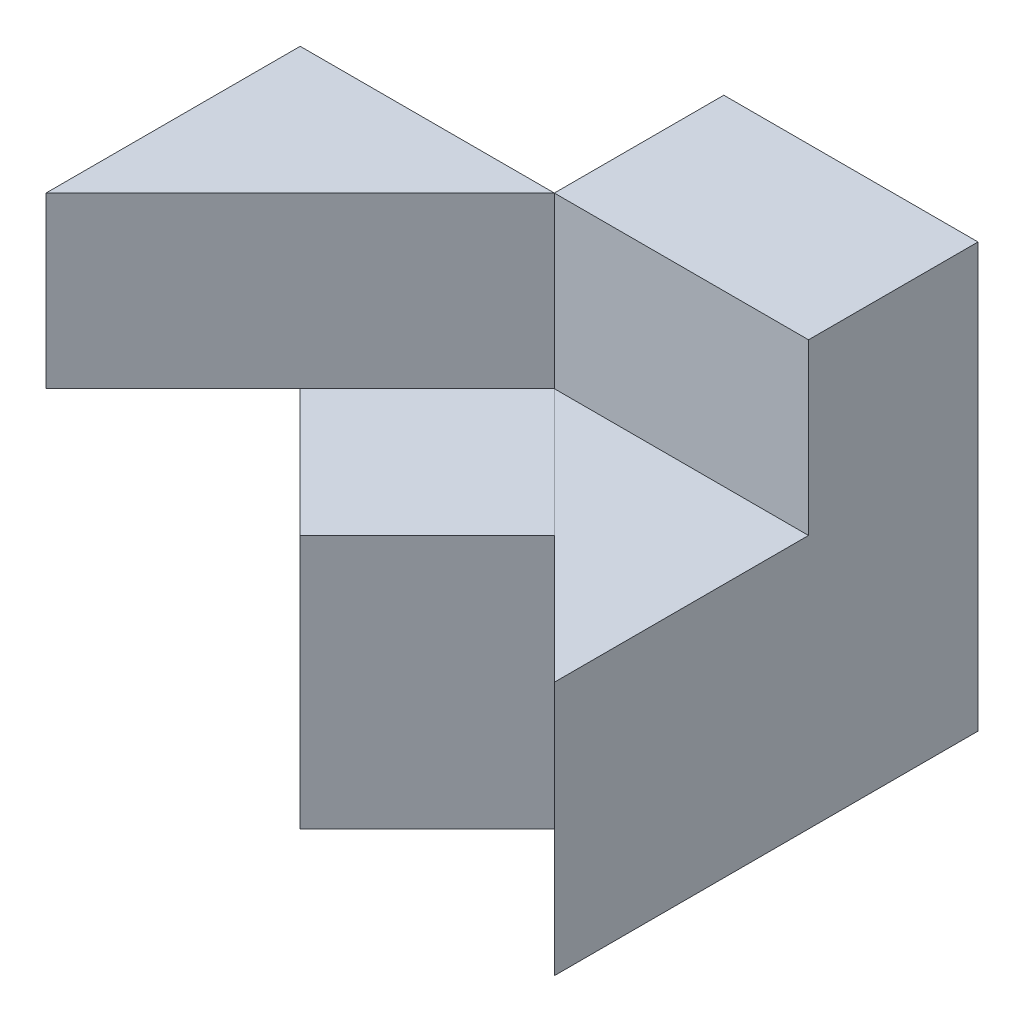
ISO-10303-21;
HEADER;
FILE_DESCRIPTION(('STEP AP214'),'2;1');
FILE_NAME('part.step','',(''),(''),'','','');
FILE_SCHEMA(('AUTOMOTIVE_DESIGN { 1 0 10303 214 1 1 1 1 }'));
ENDSEC;
DATA;
#1=APPLICATION_CONTEXT('core data for automotive mechanical design processes');
#2=APPLICATION_PROTOCOL_DEFINITION('international standard','automotive_design',2000,#1);
#3=PRODUCT_CONTEXT('',#1,'mechanical');
#4=PRODUCT('Part','Part','',(#3));
#5=PRODUCT_RELATED_PRODUCT_CATEGORY('part','',(#4));
#6=PRODUCT_DEFINITION_FORMATION('','',#4);
#7=PRODUCT_DEFINITION_CONTEXT('part definition',#1,'design');
#8=PRODUCT_DEFINITION('design','',#6,#7);
#9=PRODUCT_DEFINITION_SHAPE('','',#8);
#10=(LENGTH_UNIT() NAMED_UNIT(*) SI_UNIT(.MILLI.,.METRE.));
#11=(NAMED_UNIT(*) PLANE_ANGLE_UNIT() SI_UNIT($,.RADIAN.));
#12=(NAMED_UNIT(*) SI_UNIT($,.STERADIAN.) SOLID_ANGLE_UNIT());
#13=UNCERTAINTY_MEASURE_WITH_UNIT(LENGTH_MEASURE(1.E-05),#10,'distance_accuracy_value','');
#14=(GEOMETRIC_REPRESENTATION_CONTEXT(3) GLOBAL_UNCERTAINTY_ASSIGNED_CONTEXT((#13)) GLOBAL_UNIT_ASSIGNED_CONTEXT((#10,
#11,#12)) REPRESENTATION_CONTEXT('',''));
#15=CARTESIAN_POINT('',(0.,0.,0.));
#16=DIRECTION('',(0.,0.,1.));
#17=DIRECTION('',(1.,0.,0.));
#18=AXIS2_PLACEMENT_3D('',#15,#16,#17);
#19=CARTESIAN_POINT('',(60.,30.,20.001));
#20=DIRECTION('',(0.,-1.,0.));
#21=DIRECTION('',(1.,0.,0.));
#22=AXIS2_PLACEMENT_3D('',#19,#20,#21);
#23=PLANE('',#22);
#24=DIRECTION('',(-0.707130351805411,0.,-0.707083209781957));
#25=VECTOR('',#24,1.);
#26=CARTESIAN_POINT('',(4.99849998889148,30.,-4.99883324444111));
#27=LINE('',#26,#25);
#28=CARTESIAN_POINT('',(45.,30.,35.));
#29=VERTEX_POINT('',#28);
#30=CARTESIAN_POINT('',(30.,30.,20.001));
#31=VERTEX_POINT('',#30);
#32=EDGE_CURVE('E201',#29,#31,#27,.T.);
#33=ORIENTED_EDGE('',*,*,#32,.F.);
#34=DIRECTION('',(0.707106781186548,0.,0.707106781186547));
#35=VECTOR('',#34,1.);
#36=CARTESIAN_POINT('',(4.99999999999998,30.,-4.99999999999999));
#37=LINE('',#36,#35);
#38=CARTESIAN_POINT('',(60.,30.,50.));
#39=VERTEX_POINT('',#38);
#40=EDGE_CURVE('E275',#29,#39,#37,.T.);
#41=ORIENTED_EDGE('',*,*,#40,.T.);
#42=DIRECTION('',(0.,0.,1.));
#43=VECTOR('',#42,1.);
#44=CARTESIAN_POINT('',(60.,30.,20.001));
#45=LINE('',#44,#43);
#46=CARTESIAN_POINT('',(60.,30.,20.001));
#47=VERTEX_POINT('',#46);
#48=EDGE_CURVE('E272',#47,#39,#45,.T.);
#49=ORIENTED_EDGE('',*,*,#48,.F.);
#50=DIRECTION('',(1.,0.,0.));
#51=VECTOR('',#50,1.);
#52=CARTESIAN_POINT('',(60.,30.,20.001));
#53=LINE('',#52,#51);
#54=EDGE_CURVE('E269',#31,#47,#53,.T.);
#55=ORIENTED_EDGE('',*,*,#54,.F.);
#56=EDGE_LOOP('',(#33,#41,#49,#55));
#57=FACE_BOUND('',#56,.T.);
#58=ADVANCED_FACE('F54',(#57),#23,.F.);
#59=CARTESIAN_POINT('',(30.,30.,20.001));
#60=DIRECTION('',(0.707094995778895,0.,0.707118566397775));
#61=DIRECTION('',(0.707118566397775,0.,-0.707094995778895));
#62=AXIS2_PLACEMENT_3D('',#59,#60,#61);
#63=PLANE('',#62);
#64=DIRECTION('',(0.707118566397775,0.,-0.707094995778895));
#65=VECTOR('',#64,1.);
#66=CARTESIAN_POINT('',(30.,30.,20.001));
#67=LINE('',#66,#65);
#68=CARTESIAN_POINT('',(0.,30.,50.));
#69=VERTEX_POINT('',#68);
#70=CARTESIAN_POINT('',(15.0002500041667,30.,35.0002500041667));
#71=VERTEX_POINT('',#70);
#72=EDGE_CURVE('E234',#69,#71,#67,.T.);
#73=ORIENTED_EDGE('',*,*,#72,.T.);
#74=DIRECTION('',(0.,-1.,0.));
#75=VECTOR('',#74,1.);
#76=CARTESIAN_POINT('',(15.0002500041667,30.0001,35.0002500041667));
#77=LINE('',#76,#75);
#78=CARTESIAN_POINT('',(15.0002500041667,30.0001,35.0002500041667));
#79=VERTEX_POINT('',#78);
#80=EDGE_CURVE('E211',#79,#71,#77,.T.);
#81=ORIENTED_EDGE('',*,*,#80,.F.);
#82=DIRECTION('',(-0.707118566397775,0.,0.707094995778895));
#83=VECTOR('',#82,1.);
#84=CARTESIAN_POINT('',(24.9999999861107,30.0001,25.0008333472222));
#85=LINE('',#84,#83);
#86=CARTESIAN_POINT('',(30.,30.0001,20.001));
#87=VERTEX_POINT('',#86);
#88=EDGE_CURVE('E69',#87,#79,#85,.T.);
#89=ORIENTED_EDGE('',*,*,#88,.F.);
#90=DIRECTION('',(0.,-1.,0.));
#91=VECTOR('',#90,1.);
#92=CARTESIAN_POINT('',(30.,50.,20.001));
#93=LINE('',#92,#91);
#94=CARTESIAN_POINT('',(30.,50.,20.001));
#95=VERTEX_POINT('',#94);
#96=EDGE_CURVE('E267',#95,#87,#93,.T.);
#97=ORIENTED_EDGE('',*,*,#96,.F.);
#98=DIRECTION('',(0.707118566397775,0.,-0.707094995778895));
#99=VECTOR('',#98,1.);
#100=CARTESIAN_POINT('',(30.,50.,20.001));
#101=LINE('',#100,#99);
#102=CARTESIAN_POINT('',(0.,50.,50.));
#103=VERTEX_POINT('',#102);
#104=EDGE_CURVE('E233',#103,#95,#101,.T.);
#105=ORIENTED_EDGE('',*,*,#104,.F.);
#106=DIRECTION('',(0.,-1.,0.));
#107=VECTOR('',#106,1.);
#108=CARTESIAN_POINT('',(0.,0.,50.));
#109=LINE('',#108,#107);
#110=EDGE_CURVE('E307',#103,#69,#109,.T.);
#111=ORIENTED_EDGE('',*,*,#110,.T.);
#112=EDGE_LOOP('',(#73,#81,#89,#97,#105,#111));
#113=FACE_BOUND('',#112,.T.);
#114=ADVANCED_FACE('F371',(#113),#63,.T.);
#115=CARTESIAN_POINT('',(4.99999999999998,0.,-4.99999999999998));
#116=DIRECTION('',(-0.707106781186547,0.,0.707106781186548));
#117=DIRECTION('',(0.707106781186548,0.,0.707106781186547));
#118=AXIS2_PLACEMENT_3D('',#115,#116,#117);
#119=PLANE('',#118);
#120=DIRECTION('',(0.,1.,0.));
#121=VECTOR('',#120,1.);
#122=CARTESIAN_POINT('',(45.,0.,35.));
#123=LINE('',#122,#121);
#124=CARTESIAN_POINT('',(45.,0.0001,35.));
#125=VERTEX_POINT('',#124);
#126=EDGE_CURVE('E206',#125,#29,#123,.T.);
#127=ORIENTED_EDGE('',*,*,#126,.F.);
#128=DIRECTION('',(-0.707106781186548,0.,-0.707106781186547));
#129=VECTOR('',#128,1.);
#130=CARTESIAN_POINT('',(60.,0.0001,50.));
#131=LINE('',#130,#129);
#132=CARTESIAN_POINT('',(60.,0.0001,50.));
#133=VERTEX_POINT('',#132);
#134=EDGE_CURVE('E77',#133,#125,#131,.T.);
#135=ORIENTED_EDGE('',*,*,#134,.F.);
#136=DIRECTION('',(0.,1.,0.));
#137=VECTOR('',#136,1.);
#138=CARTESIAN_POINT('',(60.,0.,50.));
#139=LINE('',#138,#137);
#140=EDGE_CURVE('E310',#133,#39,#139,.T.);
#141=ORIENTED_EDGE('',*,*,#140,.T.);
#142=ORIENTED_EDGE('',*,*,#40,.F.);
#143=EDGE_LOOP('',(#127,#135,#141,#142));
#144=FACE_BOUND('',#143,.T.);
#145=ADVANCED_FACE('F365',(#144),#119,.T.);
#146=CARTESIAN_POINT('',(0.,0.,50.));
#147=DIRECTION('',(1.,0.,0.));
#148=DIRECTION('',(0.,0.,-1.));
#149=AXIS2_PLACEMENT_3D('',#146,#147,#148);
#150=PLANE('',#149);
#151=DIRECTION('',(0.,-1.,0.));
#152=VECTOR('',#151,1.);
#153=CARTESIAN_POINT('',(0.,29.9991,20.001));
#154=LINE('',#153,#152);
#155=CARTESIAN_POINT('',(0.,29.9991,20.001));
#156=VERTEX_POINT('',#155);
#157=CARTESIAN_POINT('',(0.,29.999,20.001));
#158=VERTEX_POINT('',#157);
#159=EDGE_CURVE('E229',#156,#158,#154,.T.);
#160=ORIENTED_EDGE('',*,*,#159,.F.);
#161=DIRECTION('',(0.,0.,-1.));
#162=VECTOR('',#161,1.);
#163=CARTESIAN_POINT('',(0.,29.9991,0.));
#164=LINE('',#163,#162);
#165=CARTESIAN_POINT('',(0.,29.9991,50.));
#166=VERTEX_POINT('',#165);
#167=EDGE_CURVE('E226',#166,#156,#164,.T.);
#168=ORIENTED_EDGE('',*,*,#167,.F.);
#169=EDGE_CURVE('E311',#69,#166,#109,.T.);
#170=ORIENTED_EDGE('',*,*,#169,.F.);
#171=ORIENTED_EDGE('',*,*,#110,.F.);
#172=DIRECTION('',(0.,0.,-1.));
#173=VECTOR('',#172,1.);
#174=CARTESIAN_POINT('',(0.,50.,50.));
#175=LINE('',#174,#173);
#176=CARTESIAN_POINT('',(0.,50.,20.));
#177=VERTEX_POINT('',#176);
#178=EDGE_CURVE('E313',#103,#177,#175,.T.);
#179=ORIENTED_EDGE('',*,*,#178,.T.);
#180=DIRECTION('',(0.,1.,0.));
#181=VECTOR('',#180,1.);
#182=CARTESIAN_POINT('',(0.,0.,20.));
#183=LINE('',#182,#181);
#184=CARTESIAN_POINT('',(0.,0.,20.));
#185=VERTEX_POINT('',#184);
#186=EDGE_CURVE('E296',#185,#177,#183,.T.);
#187=ORIENTED_EDGE('',*,*,#186,.F.);
#188=DIRECTION('',(0.,0.,-1.));
#189=VECTOR('',#188,1.);
#190=CARTESIAN_POINT('',(0.,0.,50.));
#191=LINE('',#190,#189);
#192=CARTESIAN_POINT('',(0.,0.,20.001));
#193=VERTEX_POINT('',#192);
#194=EDGE_CURVE('E62',#193,#185,#191,.T.);
#195=ORIENTED_EDGE('',*,*,#194,.F.);
#196=DIRECTION('',(0.,-1.,0.));
#197=VECTOR('',#196,1.);
#198=CARTESIAN_POINT('',(0.,0.,20.001));
#199=LINE('',#198,#197);
#200=EDGE_CURVE('E244',#158,#193,#199,.T.);
#201=ORIENTED_EDGE('',*,*,#200,.F.);
#202=EDGE_LOOP('',(#160,#168,#170,#171,#179,#187,#195,#201));
#203=FACE_BOUND('',#202,.T.);
#204=ADVANCED_FACE('F56',(#203),#150,.F.);
#205=CARTESIAN_POINT('',(25.,0.,25.));
#206=DIRECTION('',(0.707106781186548,0.,0.707106781186548));
#207=DIRECTION('',(0.707106781186548,0.,-0.707106781186548));
#208=AXIS2_PLACEMENT_3D('',#205,#206,#207);
#209=PLANE('',#208);
#210=ORIENTED_EDGE('',*,*,#169,.T.);
#211=DIRECTION('',(-0.707106781186548,0.,0.707106781186548));
#212=VECTOR('',#211,1.);
#213=CARTESIAN_POINT('',(25.,29.9991,25.));
#214=LINE('',#213,#212);
#215=CARTESIAN_POINT('',(15.,29.9991,35.));
#216=VERTEX_POINT('',#215);
#217=EDGE_CURVE('E224',#216,#166,#214,.T.);
#218=ORIENTED_EDGE('',*,*,#217,.F.);
#219=DIRECTION('',(0.,1.,0.));
#220=VECTOR('',#219,1.);
#221=CARTESIAN_POINT('',(15.,0.,35.));
#222=LINE('',#221,#220);
#223=CARTESIAN_POINT('',(15.,30.,35.));
#224=VERTEX_POINT('',#223);
#225=EDGE_CURVE('E283',#216,#224,#222,.T.);
#226=ORIENTED_EDGE('',*,*,#225,.T.);
#227=DIRECTION('',(0.707106781186548,0.,-0.707106781186548));
#228=VECTOR('',#227,1.);
#229=CARTESIAN_POINT('',(25.,30.,25.));
#230=LINE('',#229,#228);
#231=EDGE_CURVE('E237',#69,#224,#230,.T.);
#232=ORIENTED_EDGE('',*,*,#231,.F.);
#233=EDGE_LOOP('',(#210,#218,#226,#232));
#234=FACE_BOUND('',#233,.T.);
#235=ADVANCED_FACE('F402',(#234),#209,.T.);
#236=CARTESIAN_POINT('',(0.,29.999,20.001));
#237=DIRECTION('',(0.,1.,0.));
#238=DIRECTION('',(0.,0.,1.));
#239=AXIS2_PLACEMENT_3D('',#236,#237,#238);
#240=PLANE('',#239);
#241=DIRECTION('',(-0.707130351805411,0.,-0.707083209781957));
#242=VECTOR('',#241,1.);
#243=CARTESIAN_POINT('',(-10.0004999777752,29.999,10.0011667222233));
#244=LINE('',#243,#242);
#245=CARTESIAN_POINT('',(15.,29.999,35.));
#246=VERTEX_POINT('',#245);
#247=EDGE_CURVE('E221',#246,#158,#244,.T.);
#248=ORIENTED_EDGE('',*,*,#247,.T.);
#249=DIRECTION('',(-1.,0.,0.));
#250=VECTOR('',#249,1.);
#251=CARTESIAN_POINT('',(0.,29.999,20.001));
#252=LINE('',#251,#250);
#253=CARTESIAN_POINT('',(29.999,29.999,20.001));
#254=VERTEX_POINT('',#253);
#255=EDGE_CURVE('E252',#254,#158,#252,.T.);
#256=ORIENTED_EDGE('',*,*,#255,.F.);
#257=DIRECTION('',(0.,0.,1.));
#258=VECTOR('',#257,1.);
#259=CARTESIAN_POINT('',(29.999,29.999,20.001));
#260=LINE('',#259,#258);
#261=CARTESIAN_POINT('',(29.999,29.999,49.999));
#262=VERTEX_POINT('',#261);
#263=EDGE_CURVE('E256',#254,#262,#260,.T.);
#264=ORIENTED_EDGE('',*,*,#263,.T.);
#265=DIRECTION('',(-0.707106781186548,0.,-0.707106781186548));
#266=VECTOR('',#265,1.);
#267=CARTESIAN_POINT('',(-10.,29.999,10.));
#268=LINE('',#267,#266);
#269=EDGE_CURVE('E259',#262,#246,#268,.T.);
#270=ORIENTED_EDGE('',*,*,#269,.T.);
#271=EDGE_LOOP('',(#248,#256,#264,#270));
#272=FACE_BOUND('',#271,.T.);
#273=ADVANCED_FACE('F397',(#272),#240,.F.);
#274=CARTESIAN_POINT('',(-10.,0.,10.));
#275=DIRECTION('',(-0.707106781186548,0.,0.707106781186548));
#276=DIRECTION('',(0.707106781186548,0.,0.707106781186548));
#277=AXIS2_PLACEMENT_3D('',#274,#275,#276);
#278=PLANE('',#277);
#279=DIRECTION('',(0.,1.,0.));
#280=VECTOR('',#279,1.);
#281=CARTESIAN_POINT('',(30.,0.,50.));
#282=LINE('',#281,#280);
#283=CARTESIAN_POINT('',(30.,0.,50.));
#284=VERTEX_POINT('',#283);
#285=CARTESIAN_POINT('',(30.,30.0001,50.));
#286=VERTEX_POINT('',#285);
#287=EDGE_CURVE('E284',#284,#286,#282,.T.);
#288=ORIENTED_EDGE('',*,*,#287,.T.);
#289=DIRECTION('',(0.707106781186548,0.,0.707106781186547));
#290=VECTOR('',#289,1.);
#291=CARTESIAN_POINT('',(-10.,30.0001,10.));
#292=LINE('',#291,#290);
#293=EDGE_CURVE('E198',#79,#286,#292,.T.);
#294=ORIENTED_EDGE('',*,*,#293,.F.);
#295=ORIENTED_EDGE('',*,*,#80,.T.);
#296=DIRECTION('',(0.707106781186548,0.,0.707106781186547));
#297=VECTOR('',#296,1.);
#298=CARTESIAN_POINT('',(30.,30.,50.));
#299=LINE('',#298,#297);
#300=EDGE_CURVE('E242',#224,#71,#299,.T.);
#301=ORIENTED_EDGE('',*,*,#300,.F.);
#302=ORIENTED_EDGE('',*,*,#225,.F.);
#303=EDGE_CURVE('E287',#246,#216,#222,.T.);
#304=ORIENTED_EDGE('',*,*,#303,.F.);
#305=ORIENTED_EDGE('',*,*,#269,.F.);
#306=DIRECTION('',(0.,1.,0.));
#307=VECTOR('',#306,1.);
#308=CARTESIAN_POINT('',(29.999,0.,49.999));
#309=LINE('',#308,#307);
#310=CARTESIAN_POINT('',(29.999,0.,49.999));
#311=VERTEX_POINT('',#310);
#312=EDGE_CURVE('E12',#311,#262,#309,.T.);
#313=ORIENTED_EDGE('',*,*,#312,.F.);
#314=DIRECTION('',(0.707106781186548,0.,0.707106781186548));
#315=VECTOR('',#314,1.);
#316=CARTESIAN_POINT('',(-10.,0.,10.));
#317=LINE('',#316,#315);
#318=EDGE_CURVE('E281',#311,#284,#317,.T.);
#319=ORIENTED_EDGE('',*,*,#318,.T.);
#320=EDGE_LOOP('',(#288,#294,#295,#301,#302,#304,#305,#313,#319));
#321=FACE_BOUND('',#320,.T.);
#322=ADVANCED_FACE('F379',(#321),#278,.T.);
#323=CARTESIAN_POINT('',(0.,0.,50.));
#324=DIRECTION('',(0.,1.,0.));
#325=DIRECTION('',(0.,0.,1.));
#326=AXIS2_PLACEMENT_3D('',#323,#324,#325);
#327=PLANE('',#326);
#328=DIRECTION('',(0.,0.,-1.));
#329=VECTOR('',#328,1.);
#330=CARTESIAN_POINT('',(60.,0.,50.));
#331=LINE('',#330,#329);
#332=CARTESIAN_POINT('',(60.,0.,20.0000000000002));
#333=VERTEX_POINT('',#332);
#334=CARTESIAN_POINT('',(60.,0.,0.));
#335=VERTEX_POINT('',#334);
#336=EDGE_CURVE('E326',#333,#335,#331,.T.);
#337=ORIENTED_EDGE('',*,*,#336,.F.);
#338=DIRECTION('',(0.707106781186547,0.,-0.707106781186548));
#339=VECTOR('',#338,1.);
#340=CARTESIAN_POINT('',(40.,0.,40.));
#341=LINE('',#340,#339);
#342=EDGE_CURVE('E279',#284,#333,#341,.T.);
#343=ORIENTED_EDGE('',*,*,#342,.F.);
#344=ORIENTED_EDGE('',*,*,#318,.F.);
#345=DIRECTION('',(0.,0.,1.));
#346=VECTOR('',#345,1.);
#347=CARTESIAN_POINT('',(29.999,0.,20.001));
#348=LINE('',#347,#346);
#349=CARTESIAN_POINT('',(29.999,0.,20.001));
#350=VERTEX_POINT('',#349);
#351=EDGE_CURVE('E255',#350,#311,#348,.T.);
#352=ORIENTED_EDGE('',*,*,#351,.F.);
#353=DIRECTION('',(1.,0.,0.));
#354=VECTOR('',#353,1.);
#355=CARTESIAN_POINT('',(0.,0.,20.001));
#356=LINE('',#355,#354);
#357=EDGE_CURVE('E246',#193,#350,#356,.T.);
#358=ORIENTED_EDGE('',*,*,#357,.F.);
#359=ORIENTED_EDGE('',*,*,#194,.T.);
#360=DIRECTION('',(1.,0.,0.));
#361=VECTOR('',#360,1.);
#362=CARTESIAN_POINT('',(0.,0.,20.));
#363=LINE('',#362,#361);
#364=CARTESIAN_POINT('',(30.,0.,20.));
#365=VERTEX_POINT('',#364);
#366=EDGE_CURVE('E289',#185,#365,#363,.T.);
#367=ORIENTED_EDGE('',*,*,#366,.T.);
#368=DIRECTION('',(0.,0.,-1.));
#369=VECTOR('',#368,1.);
#370=CARTESIAN_POINT('',(30.,0.,0.));
#371=LINE('',#370,#369);
#372=CARTESIAN_POINT('',(30.,0.,0.));
#373=VERTEX_POINT('',#372);
#374=EDGE_CURVE('E292',#365,#373,#371,.T.);
#375=ORIENTED_EDGE('',*,*,#374,.T.);
#376=DIRECTION('',(1.,0.,0.));
#377=VECTOR('',#376,1.);
#378=CARTESIAN_POINT('',(0.,0.,0.));
#379=LINE('',#378,#377);
#380=EDGE_CURVE('E303',#373,#335,#379,.T.);
#381=ORIENTED_EDGE('',*,*,#380,.T.);
#382=EDGE_LOOP('',(#337,#343,#344,#352,#358,#359,#367,#375,#381));
#383=FACE_BOUND('',#382,.T.);
#384=ADVANCED_FACE('F332',(#383),#327,.F.);
#385=CARTESIAN_POINT('',(0.,50.,50.));
#386=DIRECTION('',(0.,-1.,0.));
#387=DIRECTION('',(0.,0.,-1.));
#388=AXIS2_PLACEMENT_3D('',#385,#386,#387);
#389=PLANE('',#388);
#390=DIRECTION('',(1.,0.,0.));
#391=VECTOR('',#390,1.);
#392=CARTESIAN_POINT('',(0.,50.,20.));
#393=LINE('',#392,#391);
#394=CARTESIAN_POINT('',(30.,50.,20.));
#395=VERTEX_POINT('',#394);
#396=EDGE_CURVE('E286',#177,#395,#393,.T.);
#397=ORIENTED_EDGE('',*,*,#396,.F.);
#398=ORIENTED_EDGE('',*,*,#178,.F.);
#399=ORIENTED_EDGE('',*,*,#104,.T.);
#400=DIRECTION('',(-1.,0.,0.));
#401=VECTOR('',#400,1.);
#402=CARTESIAN_POINT('',(60.,50.,20.001));
#403=LINE('',#402,#401);
#404=CARTESIAN_POINT('',(60.,50.,20.001));
#405=VERTEX_POINT('',#404);
#406=EDGE_CURVE('E265',#405,#95,#403,.T.);
#407=ORIENTED_EDGE('',*,*,#406,.F.);
#408=DIRECTION('',(0.,0.,-1.));
#409=VECTOR('',#408,1.);
#410=CARTESIAN_POINT('',(60.,50.,50.));
#411=LINE('',#410,#409);
#412=CARTESIAN_POINT('',(60.,50.,0.));
#413=VERTEX_POINT('',#412);
#414=EDGE_CURVE('E324',#405,#413,#411,.T.);
#415=ORIENTED_EDGE('',*,*,#414,.T.);
#416=DIRECTION('',(-1.,0.,0.));
#417=VECTOR('',#416,1.);
#418=CARTESIAN_POINT('',(0.,50.,0.));
#419=LINE('',#418,#417);
#420=CARTESIAN_POINT('',(30.,50.,0.));
#421=VERTEX_POINT('',#420);
#422=EDGE_CURVE('E319',#413,#421,#419,.T.);
#423=ORIENTED_EDGE('',*,*,#422,.T.);
#424=DIRECTION('',(0.,0.,-1.));
#425=VECTOR('',#424,1.);
#426=CARTESIAN_POINT('',(30.,50.,0.));
#427=LINE('',#426,#425);
#428=EDGE_CURVE('E293',#395,#421,#427,.T.);
#429=ORIENTED_EDGE('',*,*,#428,.F.);
#430=EDGE_LOOP('',(#397,#398,#399,#407,#415,#423,#429));
#431=FACE_BOUND('',#430,.T.);
#432=ADVANCED_FACE('F346',(#431),#389,.F.);
#433=CARTESIAN_POINT('',(60.,0.,50.));
#434=DIRECTION('',(-1.,0.,0.));
#435=DIRECTION('',(0.,0.,1.));
#436=AXIS2_PLACEMENT_3D('',#433,#434,#435);
#437=PLANE('',#436);
#438=DIRECTION('',(0.,0.,1.));
#439=VECTOR('',#438,1.);
#440=CARTESIAN_POINT('',(60.,0.0001,20.0000000000002));
#441=LINE('',#440,#439);
#442=CARTESIAN_POINT('',(60.,0.0001,20.0000000000002));
#443=VERTEX_POINT('',#442);
#444=EDGE_CURVE('E216',#443,#133,#441,.T.);
#445=ORIENTED_EDGE('',*,*,#444,.F.);
#446=DIRECTION('',(0.,-1.,0.));
#447=VECTOR('',#446,1.);
#448=CARTESIAN_POINT('',(60.,0.0001,20.0000000000002));
#449=LINE('',#448,#447);
#450=EDGE_CURVE('E218',#443,#333,#449,.T.);
#451=ORIENTED_EDGE('',*,*,#450,.T.);
#452=ORIENTED_EDGE('',*,*,#336,.T.);
#453=DIRECTION('',(0.,1.,0.));
#454=VECTOR('',#453,1.);
#455=CARTESIAN_POINT('',(60.,0.,0.));
#456=LINE('',#455,#454);
#457=EDGE_CURVE('E316',#335,#413,#456,.T.);
#458=ORIENTED_EDGE('',*,*,#457,.T.);
#459=ORIENTED_EDGE('',*,*,#414,.F.);
#460=DIRECTION('',(0.,1.,0.));
#461=VECTOR('',#460,1.);
#462=CARTESIAN_POINT('',(60.,50.,20.001));
#463=LINE('',#462,#461);
#464=EDGE_CURVE('E263',#47,#405,#463,.T.);
#465=ORIENTED_EDGE('',*,*,#464,.F.);
#466=ORIENTED_EDGE('',*,*,#48,.T.);
#467=ORIENTED_EDGE('',*,*,#140,.F.);
#468=EDGE_LOOP('',(#445,#451,#452,#458,#459,#465,#466,#467));
#469=FACE_BOUND('',#468,.T.);
#470=ADVANCED_FACE('F360',(#469),#437,.F.);
#471=CARTESIAN_POINT('',(0.,0.,0.));
#472=DIRECTION('',(0.,0.,-1.));
#473=DIRECTION('',(-1.,0.,0.));
#474=AXIS2_PLACEMENT_3D('',#471,#472,#473);
#475=PLANE('',#474);
#476=DIRECTION('',(0.,1.,0.));
#477=VECTOR('',#476,1.);
#478=CARTESIAN_POINT('',(30.,0.,0.));
#479=LINE('',#478,#477);
#480=EDGE_CURVE('E300',#373,#421,#479,.T.);
#481=ORIENTED_EDGE('',*,*,#480,.T.);
#482=ORIENTED_EDGE('',*,*,#422,.F.);
#483=ORIENTED_EDGE('',*,*,#457,.F.);
#484=ORIENTED_EDGE('',*,*,#380,.F.);
#485=EDGE_LOOP('',(#481,#482,#483,#484));
#486=FACE_BOUND('',#485,.T.);
#487=ADVANCED_FACE('F354',(#486),#475,.T.);
#488=CARTESIAN_POINT('',(30.,0.,0.));
#489=DIRECTION('',(1.,0.,0.));
#490=DIRECTION('',(0.,0.,-1.));
#491=AXIS2_PLACEMENT_3D('',#488,#489,#490);
#492=PLANE('',#491);
#493=ORIENTED_EDGE('',*,*,#428,.T.);
#494=ORIENTED_EDGE('',*,*,#480,.F.);
#495=ORIENTED_EDGE('',*,*,#374,.F.);
#496=DIRECTION('',(0.,1.,0.));
#497=VECTOR('',#496,1.);
#498=CARTESIAN_POINT('',(30.,0.,20.));
#499=LINE('',#498,#497);
#500=EDGE_CURVE('E304',#365,#395,#499,.T.);
#501=ORIENTED_EDGE('',*,*,#500,.T.);
#502=EDGE_LOOP('',(#493,#494,#495,#501));
#503=FACE_BOUND('',#502,.T.);
#504=ADVANCED_FACE('F351',(#503),#492,.F.);
#505=CARTESIAN_POINT('',(0.,0.,20.));
#506=DIRECTION('',(0.,0.,1.));
#507=DIRECTION('',(1.,0.,0.));
#508=AXIS2_PLACEMENT_3D('',#505,#506,#507);
#509=PLANE('',#508);
#510=ORIENTED_EDGE('',*,*,#396,.T.);
#511=ORIENTED_EDGE('',*,*,#500,.F.);
#512=ORIENTED_EDGE('',*,*,#366,.F.);
#513=ORIENTED_EDGE('',*,*,#186,.T.);
#514=EDGE_LOOP('',(#510,#511,#512,#513));
#515=FACE_BOUND('',#514,.T.);
#516=ADVANCED_FACE('F338',(#515),#509,.F.);
#517=CARTESIAN_POINT('',(40.,0.,40.));
#518=DIRECTION('',(0.707106781186548,0.,0.707106781186547));
#519=DIRECTION('',(0.707106781186547,0.,-0.707106781186548));
#520=AXIS2_PLACEMENT_3D('',#517,#518,#519);
#521=PLANE('',#520);
#522=ORIENTED_EDGE('',*,*,#126,.T.);
#523=DIRECTION('',(0.,-1.,0.));
#524=VECTOR('',#523,1.);
#525=CARTESIAN_POINT('',(45.,30.0001,35.));
#526=LINE('',#525,#524);
#527=CARTESIAN_POINT('',(45.,30.0001,35.));
#528=VERTEX_POINT('',#527);
#529=EDGE_CURVE('E189',#528,#29,#526,.T.);
#530=ORIENTED_EDGE('',*,*,#529,.F.);
#531=DIRECTION('',(0.707106781186547,0.,-0.707106781186548));
#532=VECTOR('',#531,1.);
#533=CARTESIAN_POINT('',(40.,30.0001,40.));
#534=LINE('',#533,#532);
#535=EDGE_CURVE('E192',#286,#528,#534,.T.);
#536=ORIENTED_EDGE('',*,*,#535,.F.);
#537=ORIENTED_EDGE('',*,*,#287,.F.);
#538=ORIENTED_EDGE('',*,*,#342,.T.);
#539=ORIENTED_EDGE('',*,*,#450,.F.);
#540=DIRECTION('',(0.707106781186551,0.,-0.707106781186544));
#541=VECTOR('',#540,1.);
#542=CARTESIAN_POINT('',(45.,0.0001,35.));
#543=LINE('',#542,#541);
#544=EDGE_CURVE('E209',#125,#443,#543,.T.);
#545=ORIENTED_EDGE('',*,*,#544,.F.);
#546=EDGE_LOOP('',(#522,#530,#536,#537,#538,#539,#545));
#547=FACE_BOUND('',#546,.T.);
#548=ADVANCED_FACE('F204',(#547),#521,.T.);
#549=CARTESIAN_POINT('',(0.,0.,20.001));
#550=DIRECTION('',(0.,0.,-1.));
#551=DIRECTION('',(-1.,0.,0.));
#552=AXIS2_PLACEMENT_3D('',#549,#550,#551);
#553=PLANE('',#552);
#554=ORIENTED_EDGE('',*,*,#464,.T.);
#555=ORIENTED_EDGE('',*,*,#406,.T.);
#556=ORIENTED_EDGE('',*,*,#96,.T.);
#557=DIRECTION('',(0.,-1.,0.));
#558=VECTOR('',#557,1.);
#559=CARTESIAN_POINT('',(30.,30.0001,20.001));
#560=LINE('',#559,#558);
#561=EDGE_CURVE('E190',#87,#31,#560,.T.);
#562=ORIENTED_EDGE('',*,*,#561,.T.);
#563=ORIENTED_EDGE('',*,*,#54,.T.);
#564=EDGE_LOOP('',(#554,#555,#556,#562,#563));
#565=FACE_BOUND('',#564,.T.);
#566=ADVANCED_FACE('F370',(#565),#553,.F.);
#567=CARTESIAN_POINT('',(29.999,0.,20.001));
#568=DIRECTION('',(1.,0.,0.));
#569=DIRECTION('',(0.,0.,-1.));
#570=AXIS2_PLACEMENT_3D('',#567,#568,#569);
#571=PLANE('',#570);
#572=ORIENTED_EDGE('',*,*,#312,.T.);
#573=ORIENTED_EDGE('',*,*,#263,.F.);
#574=DIRECTION('',(0.,1.,0.));
#575=VECTOR('',#574,1.);
#576=CARTESIAN_POINT('',(29.999,0.,20.001));
#577=LINE('',#576,#575);
#578=EDGE_CURVE('E249',#350,#254,#577,.T.);
#579=ORIENTED_EDGE('',*,*,#578,.F.);
#580=ORIENTED_EDGE('',*,*,#351,.T.);
#581=EDGE_LOOP('',(#572,#573,#579,#580));
#582=FACE_BOUND('',#581,.T.);
#583=ADVANCED_FACE('F387',(#582),#571,.F.);
#584=CARTESIAN_POINT('',(0.,0.,20.001));
#585=DIRECTION('',(0.,0.,-1.));
#586=DIRECTION('',(-1.,0.,0.));
#587=AXIS2_PLACEMENT_3D('',#584,#585,#586);
#588=PLANE('',#587);
#589=ORIENTED_EDGE('',*,*,#200,.T.);
#590=ORIENTED_EDGE('',*,*,#357,.T.);
#591=ORIENTED_EDGE('',*,*,#578,.T.);
#592=ORIENTED_EDGE('',*,*,#255,.T.);
#593=EDGE_LOOP('',(#589,#590,#591,#592));
#594=FACE_BOUND('',#593,.T.);
#595=ADVANCED_FACE('F390',(#594),#588,.F.);
#596=CARTESIAN_POINT('',(0.,30.,0.));
#597=DIRECTION('',(0.,-1.,0.));
#598=DIRECTION('',(0.,0.,-1.));
#599=AXIS2_PLACEMENT_3D('',#596,#597,#598);
#600=PLANE('',#599);
#601=ORIENTED_EDGE('',*,*,#231,.T.);
#602=ORIENTED_EDGE('',*,*,#300,.T.);
#603=ORIENTED_EDGE('',*,*,#72,.F.);
#604=EDGE_LOOP('',(#601,#602,#603));
#605=FACE_BOUND('',#604,.T.);
#606=ADVANCED_FACE('F375',(#605),#600,.T.);
#607=CARTESIAN_POINT('',(-10.0004999777752,29.9991,10.0011667222233));
#608=DIRECTION('',(-0.707083209781957,0.,0.707130351805411));
#609=DIRECTION('',(0.707130351805411,0.,0.707083209781957));
#610=AXIS2_PLACEMENT_3D('',#607,#608,#609);
#611=PLANE('',#610);
#612=ORIENTED_EDGE('',*,*,#247,.F.);
#613=ORIENTED_EDGE('',*,*,#303,.T.);
#614=DIRECTION('',(-0.707130351805411,0.,-0.707083209781957));
#615=VECTOR('',#614,1.);
#616=CARTESIAN_POINT('',(-10.0004999777752,29.9991,10.0011667222233));
#617=LINE('',#616,#615);
#618=EDGE_CURVE('E222',#216,#156,#617,.T.);
#619=ORIENTED_EDGE('',*,*,#618,.T.);
#620=ORIENTED_EDGE('',*,*,#159,.T.);
#621=EDGE_LOOP('',(#612,#613,#619,#620));
#622=FACE_BOUND('',#621,.T.);
#623=ADVANCED_FACE('F394',(#622),#611,.T.);
#624=CARTESIAN_POINT('',(0.,29.9991,0.));
#625=DIRECTION('',(0.,-1.,0.));
#626=DIRECTION('',(0.,0.,-1.));
#627=AXIS2_PLACEMENT_3D('',#624,#625,#626);
#628=PLANE('',#627);
#629=ORIENTED_EDGE('',*,*,#618,.F.);
#630=ORIENTED_EDGE('',*,*,#217,.T.);
#631=ORIENTED_EDGE('',*,*,#167,.T.);
#632=EDGE_LOOP('',(#629,#630,#631));
#633=FACE_BOUND('',#632,.T.);
#634=ADVANCED_FACE('F400',(#633),#628,.T.);
#635=CARTESIAN_POINT('',(0.,0.0001,0.));
#636=DIRECTION('',(0.,-1.,0.));
#637=DIRECTION('',(0.,0.,-1.));
#638=AXIS2_PLACEMENT_3D('',#635,#636,#637);
#639=PLANE('',#638);
#640=ORIENTED_EDGE('',*,*,#134,.T.);
#641=ORIENTED_EDGE('',*,*,#544,.T.);
#642=ORIENTED_EDGE('',*,*,#444,.T.);
#643=EDGE_LOOP('',(#640,#641,#642));
#644=FACE_BOUND('',#643,.T.);
#645=ADVANCED_FACE('F363',(#644),#639,.T.);
#646=CARTESIAN_POINT('',(4.99849998889148,30.0001,-4.99883324444111));
#647=DIRECTION('',(-0.707083209781958,0.,0.707130351805411));
#648=DIRECTION('',(0.707130351805411,0.,0.707083209781958));
#649=AXIS2_PLACEMENT_3D('',#646,#647,#648);
#650=PLANE('',#649);
#651=ORIENTED_EDGE('',*,*,#32,.T.);
#652=ORIENTED_EDGE('',*,*,#561,.F.);
#653=DIRECTION('',(-0.707130351805411,0.,-0.707083209781957));
#654=VECTOR('',#653,1.);
#655=CARTESIAN_POINT('',(4.99849998889148,30.0001,-4.99883324444111));
#656=LINE('',#655,#654);
#657=EDGE_CURVE('E184',#528,#87,#656,.T.);
#658=ORIENTED_EDGE('',*,*,#657,.F.);
#659=ORIENTED_EDGE('',*,*,#529,.T.);
#660=EDGE_LOOP('',(#651,#652,#658,#659));
#661=FACE_BOUND('',#660,.T.);
#662=ADVANCED_FACE('F187',(#661),#650,.F.);
#663=CARTESIAN_POINT('',(0.,30.0001,0.));
#664=DIRECTION('',(0.,1.,0.));
#665=DIRECTION('',(-1.,0.,0.));
#666=AXIS2_PLACEMENT_3D('',#663,#664,#665);
#667=PLANE('',#666);
#668=ORIENTED_EDGE('',*,*,#535,.T.);
#669=ORIENTED_EDGE('',*,*,#657,.T.);
#670=ORIENTED_EDGE('',*,*,#88,.T.);
#671=ORIENTED_EDGE('',*,*,#293,.T.);
#672=EDGE_LOOP('',(#668,#669,#670,#671));
#673=FACE_BOUND('',#672,.T.);
#674=ADVANCED_FACE('F196',(#673),#667,.T.);
#675=CLOSED_SHELL('',(#58,#114,#145,#204,#235,#273,#322,#384,#432,#470,#487,#504,#516,#548,#566,
#583,#595,#606,#623,#634,#645,#662,#674));
#676=MANIFOLD_SOLID_BREP('B2',#675);
#677=ADVANCED_BREP_SHAPE_REPRESENTATION('',(#18,#676),#14);
#678=SHAPE_DEFINITION_REPRESENTATION(#9,#677);
ENDSEC;
END-ISO-10303-21;
